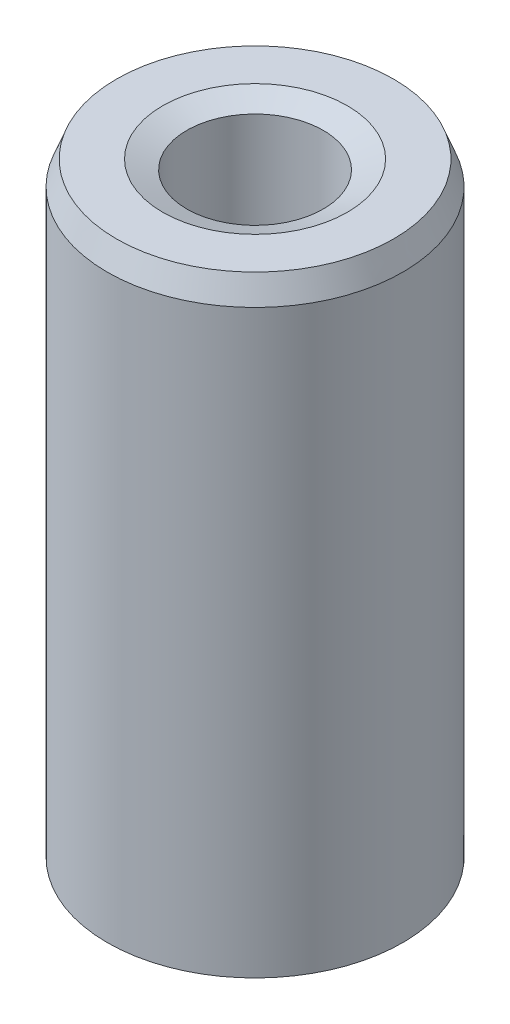
ISO-10303-21;
HEADER;
FILE_DESCRIPTION(('STEP AP214'),'2;1');
FILE_NAME('part.step','',(''),(''),'','','');
FILE_SCHEMA(('AUTOMOTIVE_DESIGN { 1 0 10303 214 1 1 1 1 }'));
ENDSEC;
DATA;
#1=APPLICATION_CONTEXT('core data for automotive mechanical design processes');
#2=APPLICATION_PROTOCOL_DEFINITION('international standard','automotive_design',2000,#1);
#3=PRODUCT_CONTEXT('',#1,'mechanical');
#4=PRODUCT('Part','Part','',(#3));
#5=PRODUCT_RELATED_PRODUCT_CATEGORY('part','',(#4));
#6=PRODUCT_DEFINITION_FORMATION('','',#4);
#7=PRODUCT_DEFINITION_CONTEXT('part definition',#1,'design');
#8=PRODUCT_DEFINITION('design','',#6,#7);
#9=PRODUCT_DEFINITION_SHAPE('','',#8);
#10=(LENGTH_UNIT() NAMED_UNIT(*) SI_UNIT(.MILLI.,.METRE.));
#11=(NAMED_UNIT(*) PLANE_ANGLE_UNIT() SI_UNIT($,.RADIAN.));
#12=(NAMED_UNIT(*) SI_UNIT($,.STERADIAN.) SOLID_ANGLE_UNIT());
#13=UNCERTAINTY_MEASURE_WITH_UNIT(LENGTH_MEASURE(1.E-05),#10,'distance_accuracy_value','');
#14=(GEOMETRIC_REPRESENTATION_CONTEXT(3) GLOBAL_UNCERTAINTY_ASSIGNED_CONTEXT((#13)) GLOBAL_UNIT_ASSIGNED_CONTEXT((#10,
#11,#12)) REPRESENTATION_CONTEXT('',''));
#15=CARTESIAN_POINT('',(0.,0.,0.));
#16=DIRECTION('',(0.,0.,1.));
#17=DIRECTION('',(1.,0.,0.));
#18=AXIS2_PLACEMENT_3D('',#15,#16,#17);
#19=CARTESIAN_POINT('',(0.,51.9348326687696,0.));
#20=DIRECTION('',(0.,-1.,0.));
#21=DIRECTION('',(0.,0.,-1.));
#22=AXIS2_PLACEMENT_3D('',#19,#20,#21);
#23=CYLINDRICAL_SURFACE('',#22,12.5);
#24=CARTESIAN_POINT('',(0.,0.783218614632569,0.));
#25=DIRECTION('',(0.,1.,0.));
#26=DIRECTION('',(0.,0.,1.));
#27=AXIS2_PLACEMENT_3D('',#24,#25,#26);
#28=CIRCLE('',#27,12.5);
#29=CARTESIAN_POINT('',(0.,0.783218614632569,12.5));
#30=VERTEX_POINT('',#29);
#31=EDGE_CURVE('E10',#30,#30,#28,.T.);
#32=ORIENTED_EDGE('',*,*,#31,.T.);
#33=EDGE_LOOP('',(#32));
#34=FACE_BOUND('',#33,.T.);
#35=CARTESIAN_POINT('',(0.,49.896071593083,0.));
#36=DIRECTION('',(0.,1.,0.));
#37=DIRECTION('',(0.,0.,1.));
#38=AXIS2_PLACEMENT_3D('',#35,#36,#37);
#39=CIRCLE('',#38,12.5);
#40=CARTESIAN_POINT('',(0.,49.896071593083,12.5));
#41=VERTEX_POINT('',#40);
#42=EDGE_CURVE('E50',#41,#41,#39,.F.);
#43=ORIENTED_EDGE('',*,*,#42,.T.);
#44=EDGE_LOOP('',(#43));
#45=FACE_BOUND('',#44,.T.);
#46=ADVANCED_FACE('F39',(#34,#45),#23,.T.);
#47=CARTESIAN_POINT('',(0.,51.9348326687696,0.));
#48=DIRECTION('',(0.,1.,0.));
#49=DIRECTION('',(0.,0.,1.));
#50=AXIS2_PLACEMENT_3D('',#47,#48,#49);
#51=PLANE('',#50);
#52=CARTESIAN_POINT('',(0.,51.9348326687696,0.));
#53=DIRECTION('',(0.,1.,0.));
#54=DIRECTION('',(0.,0.,1.));
#55=AXIS2_PLACEMENT_3D('',#52,#53,#54);
#56=CIRCLE('',#55,7.80847601157849);
#57=CARTESIAN_POINT('',(0.,51.9348326687696,7.80847601157849));
#58=VERTEX_POINT('',#57);
#59=EDGE_CURVE('E58',#58,#58,#56,.F.);
#60=ORIENTED_EDGE('',*,*,#59,.T.);
#61=EDGE_LOOP('',(#60));
#62=FACE_BOUND('',#61,.T.);
#63=CARTESIAN_POINT('',(0.,51.9348326687696,0.));
#64=DIRECTION('',(0.,1.,0.));
#65=DIRECTION('',(0.,0.,1.));
#66=AXIS2_PLACEMENT_3D('',#63,#64,#65);
#67=CIRCLE('',#66,11.7167813853674);
#68=CARTESIAN_POINT('',(0.,51.9348326687696,11.7167813853674));
#69=VERTEX_POINT('',#68);
#70=EDGE_CURVE('E61',#69,#69,#67,.T.);
#71=ORIENTED_EDGE('',*,*,#70,.T.);
#72=EDGE_LOOP('',(#71));
#73=FACE_BOUND('',#72,.T.);
#74=ADVANCED_FACE('F88',(#62,#73),#51,.T.);
#75=CARTESIAN_POINT('',(0.,0.,0.));
#76=DIRECTION('',(0.,1.,0.));
#77=DIRECTION('',(0.,0.,1.));
#78=AXIS2_PLACEMENT_3D('',#75,#76,#77);
#79=PLANE('',#78);
#80=CARTESIAN_POINT('',(0.,0.,0.));
#81=DIRECTION('',(0.,1.,0.));
#82=DIRECTION('',(0.,0.,1.));
#83=AXIS2_PLACEMENT_3D('',#80,#81,#82);
#84=CIRCLE('',#83,6.55293355052439);
#85=CARTESIAN_POINT('',(0.,0.,6.55293355052439));
#86=VERTEX_POINT('',#85);
#87=EDGE_CURVE('E51',#86,#86,#84,.T.);
#88=ORIENTED_EDGE('',*,*,#87,.T.);
#89=EDGE_LOOP('',(#88));
#90=FACE_BOUND('',#89,.T.);
#91=CARTESIAN_POINT('',(0.,0.,0.));
#92=DIRECTION('',(0.,1.,0.));
#93=DIRECTION('',(0.,0.,1.));
#94=AXIS2_PLACEMENT_3D('',#91,#92,#93);
#95=CIRCLE('',#94,10.4612389243133);
#96=CARTESIAN_POINT('',(0.,0.,10.4612389243133));
#97=VERTEX_POINT('',#96);
#98=EDGE_CURVE('E54',#97,#97,#95,.F.);
#99=ORIENTED_EDGE('',*,*,#98,.T.);
#100=EDGE_LOOP('',(#99));
#101=FACE_BOUND('',#100,.T.);
#102=ADVANCED_FACE('F83',(#90,#101),#79,.F.);
#103=CARTESIAN_POINT('',(0.,51.9348326687696,0.));
#104=DIRECTION('',(0.,-1.,0.));
#105=DIRECTION('',(0.,0.,-1.));
#106=AXIS2_PLACEMENT_3D('',#103,#104,#105);
#107=CYLINDRICAL_SURFACE('',#106,5.76971493589181);
#108=CARTESIAN_POINT('',(0.,51.151614054137,0.));
#109=DIRECTION('',(0.,1.,0.));
#110=DIRECTION('',(0.,0.,1.));
#111=AXIS2_PLACEMENT_3D('',#108,#109,#110);
#112=CIRCLE('',#111,5.76971493589181);
#113=CARTESIAN_POINT('',(0.,51.151614054137,5.76971493589181));
#114=VERTEX_POINT('',#113);
#115=EDGE_CURVE('E67',#114,#114,#112,.T.);
#116=ORIENTED_EDGE('',*,*,#115,.T.);
#117=EDGE_LOOP('',(#116));
#118=FACE_BOUND('',#117,.T.);
#119=CARTESIAN_POINT('',(0.,2.03876107568668,0.));
#120=DIRECTION('',(0.,1.,0.));
#121=DIRECTION('',(0.,0.,1.));
#122=AXIS2_PLACEMENT_3D('',#119,#120,#121);
#123=CIRCLE('',#122,5.76971493589181);
#124=CARTESIAN_POINT('',(0.,2.03876107568668,5.76971493589181));
#125=VERTEX_POINT('',#124);
#126=EDGE_CURVE('E69',#125,#125,#123,.F.);
#127=ORIENTED_EDGE('',*,*,#126,.T.);
#128=EDGE_LOOP('',(#127));
#129=FACE_BOUND('',#128,.T.);
#130=ADVANCED_FACE('F71',(#118,#129),#107,.F.);
#131=CARTESIAN_POINT('',(0.,51.151614054137,0.));
#132=DIRECTION('',(0.,1.,0.));
#133=DIRECTION('',(0.,0.,1.));
#134=AXIS2_PLACEMENT_3D('',#131,#132,#133);
#135=CONICAL_SURFACE('',#134,5.76971493589181,1.20401576689789);
#136=ORIENTED_EDGE('',*,*,#59,.F.);
#137=EDGE_LOOP('',(#136));
#138=FACE_BOUND('',#137,.T.);
#139=ORIENTED_EDGE('',*,*,#115,.F.);
#140=EDGE_LOOP('',(#139));
#141=FACE_BOUND('',#140,.T.);
#142=ADVANCED_FACE('F77',(#138,#141),#135,.F.);
#143=CARTESIAN_POINT('',(0.,0.,0.));
#144=DIRECTION('',(0.,-1.,0.));
#145=DIRECTION('',(0.,0.,-1.));
#146=AXIS2_PLACEMENT_3D('',#143,#144,#145);
#147=CONICAL_SURFACE('',#146,6.55293355052439,0.36678055989701);
#148=ORIENTED_EDGE('',*,*,#126,.F.);
#149=EDGE_LOOP('',(#148));
#150=FACE_BOUND('',#149,.T.);
#151=ORIENTED_EDGE('',*,*,#87,.F.);
#152=EDGE_LOOP('',(#151));
#153=FACE_BOUND('',#152,.T.);
#154=ADVANCED_FACE('F73',(#150,#153),#147,.F.);
#155=CARTESIAN_POINT('',(0.,0.783218614632569,0.));
#156=DIRECTION('',(0.,1.,0.));
#157=DIRECTION('',(0.,0.,1.));
#158=AXIS2_PLACEMENT_3D('',#155,#156,#157);
#159=CONICAL_SURFACE('',#158,12.5,1.20401576689789);
#160=ORIENTED_EDGE('',*,*,#98,.F.);
#161=EDGE_LOOP('',(#160));
#162=FACE_BOUND('',#161,.T.);
#163=ORIENTED_EDGE('',*,*,#31,.F.);
#164=EDGE_LOOP('',(#163));
#165=FACE_BOUND('',#164,.T.);
#166=ADVANCED_FACE('F76',(#162,#165),#159,.T.);
#167=CARTESIAN_POINT('',(0.,51.9348326687696,0.));
#168=DIRECTION('',(0.,-1.,0.));
#169=DIRECTION('',(0.,0.,-1.));
#170=AXIS2_PLACEMENT_3D('',#167,#168,#169);
#171=CONICAL_SURFACE('',#170,11.7167813853674,0.366780559897011);
#172=ORIENTED_EDGE('',*,*,#42,.F.);
#173=EDGE_LOOP('',(#172));
#174=FACE_BOUND('',#173,.T.);
#175=ORIENTED_EDGE('',*,*,#70,.F.);
#176=EDGE_LOOP('',(#175));
#177=FACE_BOUND('',#176,.T.);
#178=ADVANCED_FACE('F45',(#174,#177),#171,.T.);
#179=CLOSED_SHELL('',(#46,#74,#102,#130,#142,#154,#166,#178));
#180=MANIFOLD_SOLID_BREP('B2',#179);
#181=ADVANCED_BREP_SHAPE_REPRESENTATION('',(#18,#180),#14);
#182=SHAPE_DEFINITION_REPRESENTATION(#9,#181);
ENDSEC;
END-ISO-10303-21;
